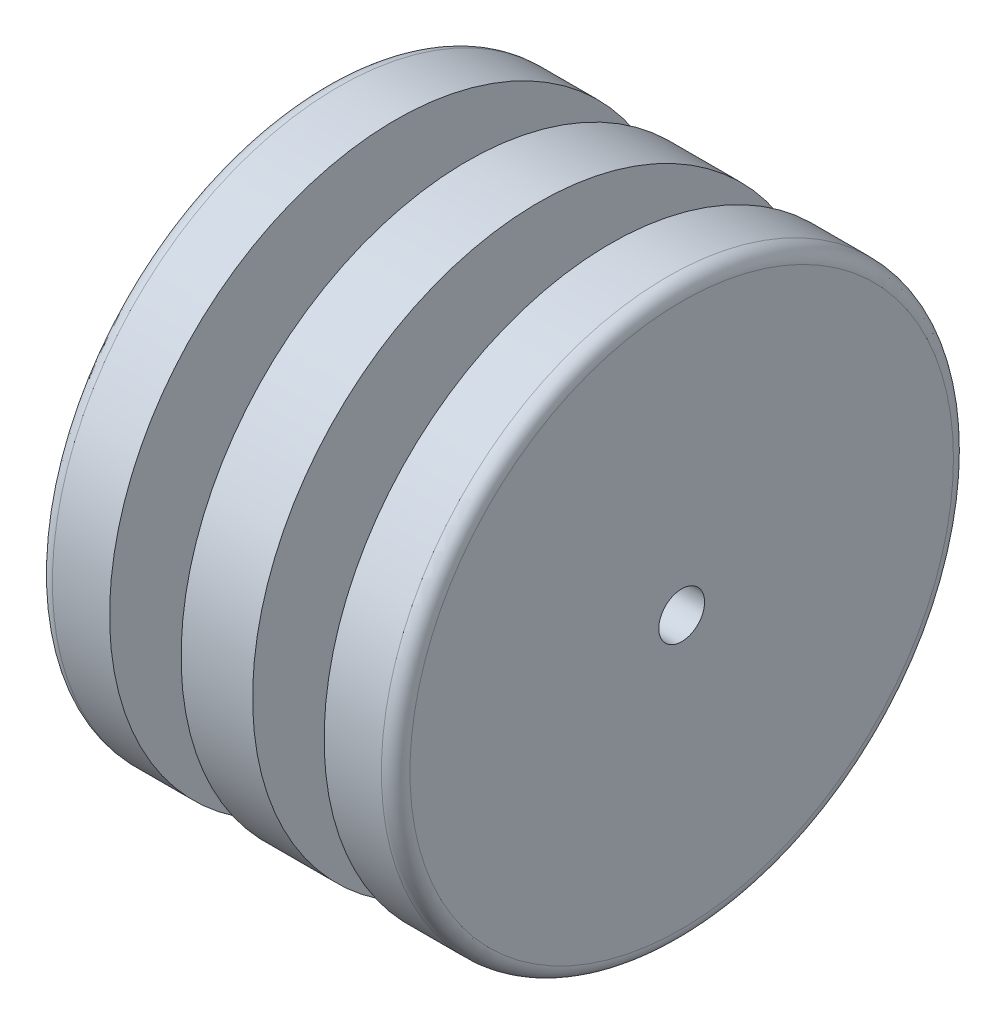
ISO-10303-21;
HEADER;
FILE_DESCRIPTION(('STEP AP214'),'2;1');
FILE_NAME('part.step','',(''),(''),'','','');
FILE_SCHEMA(('AUTOMOTIVE_DESIGN { 1 0 10303 214 1 1 1 1 }'));
ENDSEC;
DATA;
#1=APPLICATION_CONTEXT('core data for automotive mechanical design processes');
#2=APPLICATION_PROTOCOL_DEFINITION('international standard','automotive_design',2000,#1);
#3=PRODUCT_CONTEXT('',#1,'mechanical');
#4=PRODUCT('Part','Part','',(#3));
#5=PRODUCT_RELATED_PRODUCT_CATEGORY('part','',(#4));
#6=PRODUCT_DEFINITION_FORMATION('','',#4);
#7=PRODUCT_DEFINITION_CONTEXT('part definition',#1,'design');
#8=PRODUCT_DEFINITION('design','',#6,#7);
#9=PRODUCT_DEFINITION_SHAPE('','',#8);
#10=(LENGTH_UNIT() NAMED_UNIT(*) SI_UNIT(.MILLI.,.METRE.));
#11=(NAMED_UNIT(*) PLANE_ANGLE_UNIT() SI_UNIT($,.RADIAN.));
#12=(NAMED_UNIT(*) SI_UNIT($,.STERADIAN.) SOLID_ANGLE_UNIT());
#13=UNCERTAINTY_MEASURE_WITH_UNIT(LENGTH_MEASURE(1.E-05),#10,'distance_accuracy_value','');
#14=(GEOMETRIC_REPRESENTATION_CONTEXT(3) GLOBAL_UNCERTAINTY_ASSIGNED_CONTEXT((#13)) GLOBAL_UNIT_ASSIGNED_CONTEXT((#10,
#11,#12)) REPRESENTATION_CONTEXT('',''));
#15=CARTESIAN_POINT('',(0.,0.,0.));
#16=DIRECTION('',(0.,0.,1.));
#17=DIRECTION('',(1.,0.,0.));
#18=AXIS2_PLACEMENT_3D('',#15,#16,#17);
#19=CARTESIAN_POINT('',(5.,0.,0.));
#20=DIRECTION('',(-1.,0.,0.));
#21=DIRECTION('',(0.,0.,1.));
#22=AXIS2_PLACEMENT_3D('',#19,#20,#21);
#23=CYLINDRICAL_SURFACE('',#22,20.);
#24=CARTESIAN_POINT('',(1.,0.,0.));
#25=DIRECTION('',(1.,0.,0.));
#26=DIRECTION('',(0.,0.,-1.));
#27=AXIS2_PLACEMENT_3D('',#24,#25,#26);
#28=CIRCLE('',#27,20.);
#29=CARTESIAN_POINT('',(1.,0.,-20.));
#30=VERTEX_POINT('',#29);
#31=EDGE_CURVE('E49',#30,#30,#28,.T.);
#32=ORIENTED_EDGE('',*,*,#31,.T.);
#33=EDGE_LOOP('',(#32));
#34=FACE_BOUND('',#33,.T.);
#35=CARTESIAN_POINT('',(5.,0.,0.));
#36=DIRECTION('',(1.,0.,0.));
#37=DIRECTION('',(0.,0.,-1.));
#38=AXIS2_PLACEMENT_3D('',#35,#36,#37);
#39=CIRCLE('',#38,20.);
#40=CARTESIAN_POINT('',(5.,0.,-20.));
#41=VERTEX_POINT('',#40);
#42=EDGE_CURVE('E55',#41,#41,#39,.T.);
#43=ORIENTED_EDGE('',*,*,#42,.F.);
#44=EDGE_LOOP('',(#43));
#45=FACE_BOUND('',#44,.T.);
#46=ADVANCED_FACE('F34',(#34,#45),#23,.T.);
#47=CARTESIAN_POINT('',(5.,0.,0.));
#48=DIRECTION('',(1.,0.,0.));
#49=DIRECTION('',(0.,0.,-1.));
#50=AXIS2_PLACEMENT_3D('',#47,#48,#49);
#51=PLANE('',#50);
#52=CARTESIAN_POINT('',(5.,0.,0.));
#53=DIRECTION('',(1.,0.,0.));
#54=DIRECTION('',(0.,0.,-1.));
#55=AXIS2_PLACEMENT_3D('',#52,#53,#54);
#56=CIRCLE('',#55,12.5);
#57=CARTESIAN_POINT('',(5.,0.,-12.5));
#58=VERTEX_POINT('',#57);
#59=EDGE_CURVE('E58',#58,#58,#56,.T.);
#60=ORIENTED_EDGE('',*,*,#59,.F.);
#61=EDGE_LOOP('',(#60));
#62=FACE_BOUND('',#61,.T.);
#63=ORIENTED_EDGE('',*,*,#42,.T.);
#64=EDGE_LOOP('',(#63));
#65=FACE_BOUND('',#64,.T.);
#66=ADVANCED_FACE('F109',(#62,#65),#51,.T.);
#67=CARTESIAN_POINT('',(0.,0.,0.));
#68=DIRECTION('',(1.,0.,0.));
#69=DIRECTION('',(0.,0.,-1.));
#70=AXIS2_PLACEMENT_3D('',#67,#68,#69);
#71=PLANE('',#70);
#72=CARTESIAN_POINT('',(0.,0.,0.));
#73=DIRECTION('',(1.,0.,0.));
#74=DIRECTION('',(0.,0.,-1.));
#75=AXIS2_PLACEMENT_3D('',#72,#73,#74);
#76=CIRCLE('',#75,1.6);
#77=CARTESIAN_POINT('',(0.,0.,-1.6));
#78=VERTEX_POINT('',#77);
#79=EDGE_CURVE('E78',#78,#78,#76,.T.);
#80=ORIENTED_EDGE('',*,*,#79,.T.);
#81=EDGE_LOOP('',(#80));
#82=FACE_BOUND('',#81,.T.);
#83=CARTESIAN_POINT('',(0.,0.,0.));
#84=DIRECTION('',(1.,0.,0.));
#85=DIRECTION('',(0.,0.,-1.));
#86=AXIS2_PLACEMENT_3D('',#83,#84,#85);
#87=CIRCLE('',#86,19.);
#88=CARTESIAN_POINT('',(0.,0.,-19.));
#89=VERTEX_POINT('',#88);
#90=EDGE_CURVE('E45',#89,#89,#87,.F.);
#91=ORIENTED_EDGE('',*,*,#90,.T.);
#92=EDGE_LOOP('',(#91));
#93=FACE_BOUND('',#92,.T.);
#94=ADVANCED_FACE('F85',(#82,#93),#71,.F.);
#95=CARTESIAN_POINT('',(10.,0.,0.));
#96=DIRECTION('',(-1.,0.,0.));
#97=DIRECTION('',(0.,0.,1.));
#98=AXIS2_PLACEMENT_3D('',#95,#96,#97);
#99=CYLINDRICAL_SURFACE('',#98,12.5);
#100=CARTESIAN_POINT('',(10.,0.,0.));
#101=DIRECTION('',(1.,0.,0.));
#102=DIRECTION('',(0.,0.,-1.));
#103=AXIS2_PLACEMENT_3D('',#100,#101,#102);
#104=CIRCLE('',#103,12.5);
#105=CARTESIAN_POINT('',(10.,0.,-12.5));
#106=VERTEX_POINT('',#105);
#107=EDGE_CURVE('E59',#106,#106,#104,.T.);
#108=ORIENTED_EDGE('',*,*,#107,.F.);
#109=EDGE_LOOP('',(#108));
#110=FACE_BOUND('',#109,.T.);
#111=ORIENTED_EDGE('',*,*,#59,.T.);
#112=EDGE_LOOP('',(#111));
#113=FACE_BOUND('',#112,.T.);
#114=ADVANCED_FACE('F129',(#110,#113),#99,.T.);
#115=CARTESIAN_POINT('',(15.,0.,0.));
#116=DIRECTION('',(-1.,0.,0.));
#117=DIRECTION('',(0.,0.,1.));
#118=AXIS2_PLACEMENT_3D('',#115,#116,#117);
#119=CYLINDRICAL_SURFACE('',#118,20.);
#120=CARTESIAN_POINT('',(15.,0.,0.));
#121=DIRECTION('',(1.,0.,0.));
#122=DIRECTION('',(0.,0.,-1.));
#123=AXIS2_PLACEMENT_3D('',#120,#121,#122);
#124=CIRCLE('',#123,20.);
#125=CARTESIAN_POINT('',(15.,0.,-20.));
#126=VERTEX_POINT('',#125);
#127=EDGE_CURVE('E64',#126,#126,#124,.T.);
#128=ORIENTED_EDGE('',*,*,#127,.F.);
#129=EDGE_LOOP('',(#128));
#130=FACE_BOUND('',#129,.T.);
#131=CARTESIAN_POINT('',(10.,0.,0.));
#132=DIRECTION('',(1.,0.,0.));
#133=DIRECTION('',(0.,0.,-1.));
#134=AXIS2_PLACEMENT_3D('',#131,#132,#133);
#135=CIRCLE('',#134,20.);
#136=CARTESIAN_POINT('',(10.,0.,-20.));
#137=VERTEX_POINT('',#136);
#138=EDGE_CURVE('E65',#137,#137,#135,.T.);
#139=ORIENTED_EDGE('',*,*,#138,.T.);
#140=EDGE_LOOP('',(#139));
#141=FACE_BOUND('',#140,.T.);
#142=ADVANCED_FACE('F133',(#130,#141),#119,.T.);
#143=CARTESIAN_POINT('',(15.,0.,0.));
#144=DIRECTION('',(1.,0.,0.));
#145=DIRECTION('',(0.,0.,-1.));
#146=AXIS2_PLACEMENT_3D('',#143,#144,#145);
#147=PLANE('',#146);
#148=CARTESIAN_POINT('',(15.,0.,0.));
#149=DIRECTION('',(1.,0.,0.));
#150=DIRECTION('',(0.,0.,-1.));
#151=AXIS2_PLACEMENT_3D('',#148,#149,#150);
#152=CIRCLE('',#151,12.5);
#153=CARTESIAN_POINT('',(15.,0.,-12.5));
#154=VERTEX_POINT('',#153);
#155=EDGE_CURVE('E54',#154,#154,#152,.T.);
#156=ORIENTED_EDGE('',*,*,#155,.F.);
#157=EDGE_LOOP('',(#156));
#158=FACE_BOUND('',#157,.T.);
#159=ORIENTED_EDGE('',*,*,#127,.T.);
#160=EDGE_LOOP('',(#159));
#161=FACE_BOUND('',#160,.T.);
#162=ADVANCED_FACE('F139',(#158,#161),#147,.T.);
#163=CARTESIAN_POINT('',(10.,0.,0.));
#164=DIRECTION('',(1.,0.,0.));
#165=DIRECTION('',(0.,0.,-1.));
#166=AXIS2_PLACEMENT_3D('',#163,#164,#165);
#167=PLANE('',#166);
#168=ORIENTED_EDGE('',*,*,#107,.T.);
#169=EDGE_LOOP('',(#168));
#170=FACE_BOUND('',#169,.T.);
#171=ORIENTED_EDGE('',*,*,#138,.F.);
#172=EDGE_LOOP('',(#171));
#173=FACE_BOUND('',#172,.T.);
#174=ADVANCED_FACE('F145',(#170,#173),#167,.F.);
#175=CARTESIAN_POINT('',(20.,0.,0.));
#176=DIRECTION('',(-1.,0.,0.));
#177=DIRECTION('',(0.,0.,1.));
#178=AXIS2_PLACEMENT_3D('',#175,#176,#177);
#179=CYLINDRICAL_SURFACE('',#178,12.5);
#180=CARTESIAN_POINT('',(20.,0.,0.));
#181=DIRECTION('',(1.,0.,0.));
#182=DIRECTION('',(0.,0.,-1.));
#183=AXIS2_PLACEMENT_3D('',#180,#181,#182);
#184=CIRCLE('',#183,12.5);
#185=CARTESIAN_POINT('',(20.,0.,-12.5));
#186=VERTEX_POINT('',#185);
#187=EDGE_CURVE('E68',#186,#186,#184,.T.);
#188=ORIENTED_EDGE('',*,*,#187,.F.);
#189=EDGE_LOOP('',(#188));
#190=FACE_BOUND('',#189,.T.);
#191=ORIENTED_EDGE('',*,*,#155,.T.);
#192=EDGE_LOOP('',(#191));
#193=FACE_BOUND('',#192,.T.);
#194=ADVANCED_FACE('F106',(#190,#193),#179,.T.);
#195=CARTESIAN_POINT('',(25.,0.,0.));
#196=DIRECTION('',(-1.,0.,0.));
#197=DIRECTION('',(0.,0.,1.));
#198=AXIS2_PLACEMENT_3D('',#195,#196,#197);
#199=CYLINDRICAL_SURFACE('',#198,20.);
#200=CARTESIAN_POINT('',(24.,0.,0.));
#201=DIRECTION('',(1.,0.,0.));
#202=DIRECTION('',(0.,0.,-1.));
#203=AXIS2_PLACEMENT_3D('',#200,#201,#202);
#204=CIRCLE('',#203,20.);
#205=CARTESIAN_POINT('',(24.,0.,-20.));
#206=VERTEX_POINT('',#205);
#207=EDGE_CURVE('E10',#206,#206,#204,.F.);
#208=ORIENTED_EDGE('',*,*,#207,.T.);
#209=EDGE_LOOP('',(#208));
#210=FACE_BOUND('',#209,.T.);
#211=CARTESIAN_POINT('',(20.,0.,0.));
#212=DIRECTION('',(1.,0.,0.));
#213=DIRECTION('',(0.,0.,-1.));
#214=AXIS2_PLACEMENT_3D('',#211,#212,#213);
#215=CIRCLE('',#214,20.);
#216=CARTESIAN_POINT('',(20.,0.,-20.));
#217=VERTEX_POINT('',#216);
#218=EDGE_CURVE('E75',#217,#217,#215,.T.);
#219=ORIENTED_EDGE('',*,*,#218,.T.);
#220=EDGE_LOOP('',(#219));
#221=FACE_BOUND('',#220,.T.);
#222=ADVANCED_FACE('F97',(#210,#221),#199,.T.);
#223=CARTESIAN_POINT('',(25.,0.,0.));
#224=DIRECTION('',(1.,0.,0.));
#225=DIRECTION('',(0.,0.,-1.));
#226=AXIS2_PLACEMENT_3D('',#223,#224,#225);
#227=PLANE('',#226);
#228=CARTESIAN_POINT('',(25.,0.,0.));
#229=DIRECTION('',(1.,0.,0.));
#230=DIRECTION('',(0.,0.,-1.));
#231=AXIS2_PLACEMENT_3D('',#228,#229,#230);
#232=CIRCLE('',#231,1.6);
#233=CARTESIAN_POINT('',(25.,0.,-1.6));
#234=VERTEX_POINT('',#233);
#235=EDGE_CURVE('E79',#234,#234,#232,.T.);
#236=ORIENTED_EDGE('',*,*,#235,.F.);
#237=EDGE_LOOP('',(#236));
#238=FACE_BOUND('',#237,.T.);
#239=CARTESIAN_POINT('',(25.,0.,0.));
#240=DIRECTION('',(1.,0.,0.));
#241=DIRECTION('',(0.,0.,-1.));
#242=AXIS2_PLACEMENT_3D('',#239,#240,#241);
#243=CIRCLE('',#242,19.);
#244=CARTESIAN_POINT('',(25.,0.,-19.));
#245=VERTEX_POINT('',#244);
#246=EDGE_CURVE('E41',#245,#245,#243,.T.);
#247=ORIENTED_EDGE('',*,*,#246,.T.);
#248=EDGE_LOOP('',(#247));
#249=FACE_BOUND('',#248,.T.);
#250=ADVANCED_FACE('F94',(#238,#249),#227,.T.);
#251=CARTESIAN_POINT('',(20.,0.,0.));
#252=DIRECTION('',(1.,0.,0.));
#253=DIRECTION('',(0.,0.,-1.));
#254=AXIS2_PLACEMENT_3D('',#251,#252,#253);
#255=PLANE('',#254);
#256=ORIENTED_EDGE('',*,*,#187,.T.);
#257=EDGE_LOOP('',(#256));
#258=FACE_BOUND('',#257,.T.);
#259=ORIENTED_EDGE('',*,*,#218,.F.);
#260=EDGE_LOOP('',(#259));
#261=FACE_BOUND('',#260,.T.);
#262=ADVANCED_FACE('F96',(#258,#261),#255,.F.);
#263=CARTESIAN_POINT('',(1.,0.,0.));
#264=DIRECTION('',(1.,0.,0.));
#265=DIRECTION('',(0.,0.,-1.));
#266=AXIS2_PLACEMENT_3D('',#263,#264,#265);
#267=TOROIDAL_SURFACE('',#266,19.,1.);
#268=ORIENTED_EDGE('',*,*,#90,.F.);
#269=EDGE_LOOP('',(#268));
#270=FACE_BOUND('',#269,.T.);
#271=ORIENTED_EDGE('',*,*,#31,.F.);
#272=EDGE_LOOP('',(#271));
#273=FACE_BOUND('',#272,.T.);
#274=ADVANCED_FACE('F103',(#270,#273),#267,.T.);
#275=CARTESIAN_POINT('',(24.,0.,0.));
#276=DIRECTION('',(1.,0.,0.));
#277=DIRECTION('',(0.,0.,-1.));
#278=AXIS2_PLACEMENT_3D('',#275,#276,#277);
#279=TOROIDAL_SURFACE('',#278,19.,1.);
#280=ORIENTED_EDGE('',*,*,#207,.F.);
#281=EDGE_LOOP('',(#280));
#282=FACE_BOUND('',#281,.T.);
#283=ORIENTED_EDGE('',*,*,#246,.F.);
#284=EDGE_LOOP('',(#283));
#285=FACE_BOUND('',#284,.T.);
#286=ADVANCED_FACE('F36',(#282,#285),#279,.T.);
#287=CARTESIAN_POINT('',(0.,0.,0.));
#288=DIRECTION('',(1.,0.,0.));
#289=DIRECTION('',(0.,0.,-1.));
#290=AXIS2_PLACEMENT_3D('',#287,#288,#289);
#291=CYLINDRICAL_SURFACE('',#290,1.6);
#292=ORIENTED_EDGE('',*,*,#79,.F.);
#293=EDGE_LOOP('',(#292));
#294=FACE_BOUND('',#293,.T.);
#295=ORIENTED_EDGE('',*,*,#235,.T.);
#296=EDGE_LOOP('',(#295));
#297=FACE_BOUND('',#296,.T.);
#298=ADVANCED_FACE('F88',(#294,#297),#291,.F.);
#299=CLOSED_SHELL('',(#46,#66,#94,#114,#142,#162,#174,#194,#222,#250,#262,#274,#286,#298));
#300=MANIFOLD_SOLID_BREP('B2',#299);
#301=ADVANCED_BREP_SHAPE_REPRESENTATION('',(#18,#300),#14);
#302=SHAPE_DEFINITION_REPRESENTATION(#9,#301);
ENDSEC;
END-ISO-10303-21;
